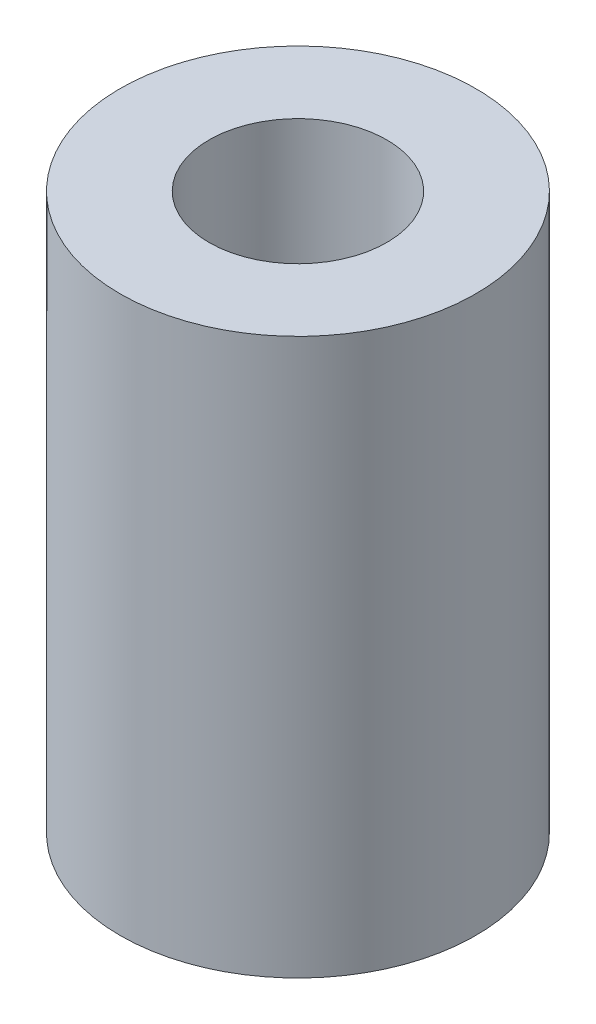
ISO-10303-21;
HEADER;
FILE_DESCRIPTION(('STEP AP214'),'2;1');
FILE_NAME('part.step','',(''),(''),'','','');
FILE_SCHEMA(('AUTOMOTIVE_DESIGN { 1 0 10303 214 1 1 1 1 }'));
ENDSEC;
DATA;
#1=APPLICATION_CONTEXT('core data for automotive mechanical design processes');
#2=APPLICATION_PROTOCOL_DEFINITION('international standard','automotive_design',2000,#1);
#3=PRODUCT_CONTEXT('',#1,'mechanical');
#4=PRODUCT('Part','Part','',(#3));
#5=PRODUCT_RELATED_PRODUCT_CATEGORY('part','',(#4));
#6=PRODUCT_DEFINITION_FORMATION('','',#4);
#7=PRODUCT_DEFINITION_CONTEXT('part definition',#1,'design');
#8=PRODUCT_DEFINITION('design','',#6,#7);
#9=PRODUCT_DEFINITION_SHAPE('','',#8);
#10=(LENGTH_UNIT() NAMED_UNIT(*) SI_UNIT(.MILLI.,.METRE.));
#11=(NAMED_UNIT(*) PLANE_ANGLE_UNIT() SI_UNIT($,.RADIAN.));
#12=(NAMED_UNIT(*) SI_UNIT($,.STERADIAN.) SOLID_ANGLE_UNIT());
#13=UNCERTAINTY_MEASURE_WITH_UNIT(LENGTH_MEASURE(1.E-05),#10,'distance_accuracy_value','');
#14=(GEOMETRIC_REPRESENTATION_CONTEXT(3) GLOBAL_UNCERTAINTY_ASSIGNED_CONTEXT((#13)) GLOBAL_UNIT_ASSIGNED_CONTEXT((#10,
#11,#12)) REPRESENTATION_CONTEXT('',''));
#15=CARTESIAN_POINT('',(0.,0.,0.));
#16=DIRECTION('',(0.,0.,1.));
#17=DIRECTION('',(1.,0.,0.));
#18=AXIS2_PLACEMENT_3D('',#15,#16,#17);
#19=CARTESIAN_POINT('',(0.,25.,0.));
#20=DIRECTION('',(0.,1.,0.));
#21=DIRECTION('',(0.,0.,1.));
#22=AXIS2_PLACEMENT_3D('',#19,#20,#21);
#23=PLANE('',#22);
#24=CARTESIAN_POINT('',(0.,25.,0.));
#25=DIRECTION('',(0.,1.,0.));
#26=DIRECTION('',(0.,0.,1.));
#27=AXIS2_PLACEMENT_3D('',#24,#25,#26);
#28=CIRCLE('',#27,8.);
#29=CARTESIAN_POINT('',(0.,25.,8.));
#30=VERTEX_POINT('',#29);
#31=EDGE_CURVE('E10',#30,#30,#28,.T.);
#32=ORIENTED_EDGE('',*,*,#31,.T.);
#33=EDGE_LOOP('',(#32));
#34=FACE_BOUND('',#33,.T.);
#35=CARTESIAN_POINT('',(0.,25.,0.));
#36=DIRECTION('',(0.,1.,0.));
#37=DIRECTION('',(0.,0.,1.));
#38=AXIS2_PLACEMENT_3D('',#35,#36,#37);
#39=CIRCLE('',#38,4.);
#40=CARTESIAN_POINT('',(0.,25.,4.));
#41=VERTEX_POINT('',#40);
#42=EDGE_CURVE('E42',#41,#41,#39,.T.);
#43=ORIENTED_EDGE('',*,*,#42,.F.);
#44=EDGE_LOOP('',(#43));
#45=FACE_BOUND('',#44,.T.);
#46=ADVANCED_FACE('F31',(#34,#45),#23,.T.);
#47=CARTESIAN_POINT('',(0.,0.,0.));
#48=DIRECTION('',(0.,1.,0.));
#49=DIRECTION('',(0.,0.,1.));
#50=AXIS2_PLACEMENT_3D('',#47,#48,#49);
#51=PLANE('',#50);
#52=CARTESIAN_POINT('',(0.,0.,0.));
#53=DIRECTION('',(0.,1.,0.));
#54=DIRECTION('',(0.,0.,1.));
#55=AXIS2_PLACEMENT_3D('',#52,#53,#54);
#56=CIRCLE('',#55,8.);
#57=CARTESIAN_POINT('',(0.,0.,8.));
#58=VERTEX_POINT('',#57);
#59=EDGE_CURVE('E35',#58,#58,#56,.T.);
#60=ORIENTED_EDGE('',*,*,#59,.F.);
#61=EDGE_LOOP('',(#60));
#62=FACE_BOUND('',#61,.T.);
#63=CARTESIAN_POINT('',(0.,0.,0.));
#64=DIRECTION('',(0.,1.,0.));
#65=DIRECTION('',(0.,0.,1.));
#66=AXIS2_PLACEMENT_3D('',#63,#64,#65);
#67=CIRCLE('',#66,4.);
#68=CARTESIAN_POINT('',(0.,0.,4.));
#69=VERTEX_POINT('',#68);
#70=EDGE_CURVE('E44',#69,#69,#67,.T.);
#71=ORIENTED_EDGE('',*,*,#70,.T.);
#72=EDGE_LOOP('',(#71));
#73=FACE_BOUND('',#72,.T.);
#74=ADVANCED_FACE('F54',(#62,#73),#51,.F.);
#75=CARTESIAN_POINT('',(0.,25.,0.));
#76=DIRECTION('',(0.,-1.,0.));
#77=DIRECTION('',(0.,0.,-1.));
#78=AXIS2_PLACEMENT_3D('',#75,#76,#77);
#79=CYLINDRICAL_SURFACE('',#78,8.);
#80=ORIENTED_EDGE('',*,*,#31,.F.);
#81=EDGE_LOOP('',(#80));
#82=FACE_BOUND('',#81,.T.);
#83=ORIENTED_EDGE('',*,*,#59,.T.);
#84=EDGE_LOOP('',(#83));
#85=FACE_BOUND('',#84,.T.);
#86=ADVANCED_FACE('F33',(#82,#85),#79,.T.);
#87=CARTESIAN_POINT('',(0.,25.,0.));
#88=DIRECTION('',(0.,-1.,0.));
#89=DIRECTION('',(0.,0.,-1.));
#90=AXIS2_PLACEMENT_3D('',#87,#88,#89);
#91=CYLINDRICAL_SURFACE('',#90,4.);
#92=ORIENTED_EDGE('',*,*,#42,.T.);
#93=EDGE_LOOP('',(#92));
#94=FACE_BOUND('',#93,.T.);
#95=ORIENTED_EDGE('',*,*,#70,.F.);
#96=EDGE_LOOP('',(#95));
#97=FACE_BOUND('',#96,.T.);
#98=ADVANCED_FACE('F50',(#94,#97),#91,.F.);
#99=CLOSED_SHELL('',(#46,#74,#86,#98));
#100=MANIFOLD_SOLID_BREP('B2',#99);
#101=ADVANCED_BREP_SHAPE_REPRESENTATION('',(#18,#100),#14);
#102=SHAPE_DEFINITION_REPRESENTATION(#9,#101);
ENDSEC;
END-ISO-10303-21;
